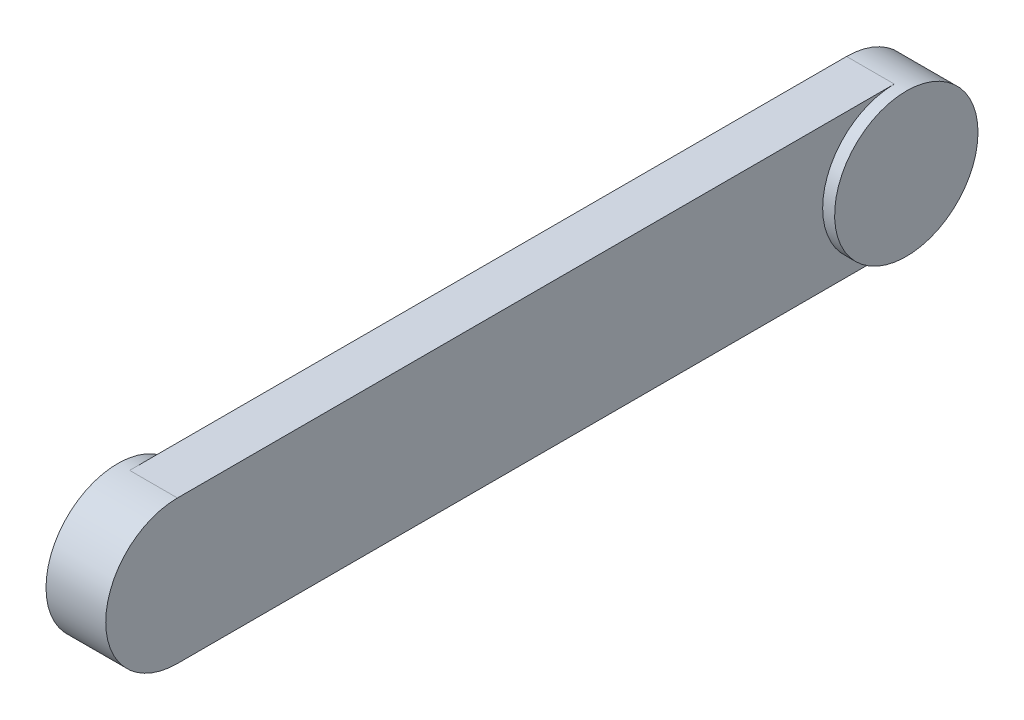
ISO-10303-21;
HEADER;
FILE_DESCRIPTION(('STEP AP214'),'2;1');
FILE_NAME('part.step','',(''),(''),'','','');
FILE_SCHEMA(('AUTOMOTIVE_DESIGN { 1 0 10303 214 1 1 1 1 }'));
ENDSEC;
DATA;
#1=APPLICATION_CONTEXT('core data for automotive mechanical design processes');
#2=APPLICATION_PROTOCOL_DEFINITION('international standard','automotive_design',2000,#1);
#3=PRODUCT_CONTEXT('',#1,'mechanical');
#4=PRODUCT('Part','Part','',(#3));
#5=PRODUCT_RELATED_PRODUCT_CATEGORY('part','',(#4));
#6=PRODUCT_DEFINITION_FORMATION('','',#4);
#7=PRODUCT_DEFINITION_CONTEXT('part definition',#1,'design');
#8=PRODUCT_DEFINITION('design','',#6,#7);
#9=PRODUCT_DEFINITION_SHAPE('','',#8);
#10=(LENGTH_UNIT() NAMED_UNIT(*) SI_UNIT(.MILLI.,.METRE.));
#11=(NAMED_UNIT(*) PLANE_ANGLE_UNIT() SI_UNIT($,.RADIAN.));
#12=(NAMED_UNIT(*) SI_UNIT($,.STERADIAN.) SOLID_ANGLE_UNIT());
#13=UNCERTAINTY_MEASURE_WITH_UNIT(LENGTH_MEASURE(1.E-05),#10,'distance_accuracy_value','');
#14=(GEOMETRIC_REPRESENTATION_CONTEXT(3) GLOBAL_UNCERTAINTY_ASSIGNED_CONTEXT((#13)) GLOBAL_UNIT_ASSIGNED_CONTEXT((#10,
#11,#12)) REPRESENTATION_CONTEXT('',''));
#15=CARTESIAN_POINT('',(0.,0.,0.));
#16=DIRECTION('',(0.,0.,1.));
#17=DIRECTION('',(1.,0.,0.));
#18=AXIS2_PLACEMENT_3D('',#15,#16,#17);
#19=CARTESIAN_POINT('',(0.,0.,0.));
#20=DIRECTION('',(1.,0.,0.));
#21=DIRECTION('',(0.,0.,-1.));
#22=AXIS2_PLACEMENT_3D('',#19,#20,#21);
#23=PLANE('',#22);
#24=CARTESIAN_POINT('',(0.,0.,0.));
#25=DIRECTION('',(-1.,0.,0.));
#26=DIRECTION('',(0.,0.,1.));
#27=AXIS2_PLACEMENT_3D('',#24,#25,#26);
#28=CIRCLE('',#27,30.);
#29=CARTESIAN_POINT('',(0.,30.,0.));
#30=VERTEX_POINT('',#29);
#31=CARTESIAN_POINT('',(0.,-30.,0.));
#32=VERTEX_POINT('',#31);
#33=EDGE_CURVE('E86',#30,#32,#28,.T.);
#34=ORIENTED_EDGE('',*,*,#33,.F.);
#35=DIRECTION('',(0.,0.,1.));
#36=VECTOR('',#35,1.);
#37=CARTESIAN_POINT('',(0.,30.,0.));
#38=LINE('',#37,#36);
#39=CARTESIAN_POINT('',(0.,30.,-300.));
#40=VERTEX_POINT('',#39);
#41=EDGE_CURVE('E88',#40,#30,#38,.T.);
#42=ORIENTED_EDGE('',*,*,#41,.F.);
#43=CARTESIAN_POINT('',(0.,0.,-300.));
#44=DIRECTION('',(1.,0.,0.));
#45=DIRECTION('',(0.,0.,-1.));
#46=AXIS2_PLACEMENT_3D('',#43,#44,#45);
#47=CIRCLE('',#46,30.);
#48=CARTESIAN_POINT('',(0.,-30.,-300.));
#49=VERTEX_POINT('',#48);
#50=EDGE_CURVE('E76',#49,#40,#47,.T.);
#51=ORIENTED_EDGE('',*,*,#50,.F.);
#52=DIRECTION('',(0.,0.,-1.));
#53=VECTOR('',#52,1.);
#54=CARTESIAN_POINT('',(0.,-30.,0.));
#55=LINE('',#54,#53);
#56=EDGE_CURVE('E70',#32,#49,#55,.T.);
#57=ORIENTED_EDGE('',*,*,#56,.F.);
#58=EDGE_LOOP('',(#34,#42,#51,#57));
#59=FACE_BOUND('',#58,.T.);
#60=ADVANCED_FACE('F38',(#59),#23,.F.);
#61=CARTESIAN_POINT('',(20.,0.,0.));
#62=DIRECTION('',(-1.,0.,0.));
#63=DIRECTION('',(0.,0.,1.));
#64=AXIS2_PLACEMENT_3D('',#61,#62,#63);
#65=CYLINDRICAL_SURFACE('',#64,30.);
#66=DIRECTION('',(-1.,0.,0.));
#67=VECTOR('',#66,1.);
#68=CARTESIAN_POINT('',(20.,30.,0.));
#69=LINE('',#68,#67);
#70=CARTESIAN_POINT('',(20.,30.,0.));
#71=VERTEX_POINT('',#70);
#72=EDGE_CURVE('E96',#71,#30,#69,.T.);
#73=ORIENTED_EDGE('',*,*,#72,.T.);
#74=ORIENTED_EDGE('',*,*,#33,.T.);
#75=DIRECTION('',(-1.,0.,0.));
#76=VECTOR('',#75,1.);
#77=CARTESIAN_POINT('',(20.,-30.,0.));
#78=LINE('',#77,#76);
#79=CARTESIAN_POINT('',(20.,-30.,0.));
#80=VERTEX_POINT('',#79);
#81=EDGE_CURVE('E11',#80,#32,#78,.T.);
#82=ORIENTED_EDGE('',*,*,#81,.F.);
#83=CARTESIAN_POINT('',(20.,0.,0.));
#84=DIRECTION('',(1.,0.,0.));
#85=DIRECTION('',(0.,0.,-1.));
#86=AXIS2_PLACEMENT_3D('',#83,#84,#85);
#87=CIRCLE('',#86,30.);
#88=EDGE_CURVE('E99',#71,#80,#87,.T.);
#89=ORIENTED_EDGE('',*,*,#88,.F.);
#90=EDGE_LOOP('',(#73,#74,#82,#89));
#91=FACE_BOUND('',#90,.T.);
#92=CARTESIAN_POINT('',(-5.,0.,0.));
#93=DIRECTION('',(-1.,0.,0.));
#94=DIRECTION('',(0.,0.,1.));
#95=AXIS2_PLACEMENT_3D('',#92,#93,#94);
#96=CIRCLE('',#95,30.);
#97=CARTESIAN_POINT('',(-5.,0.,30.));
#98=VERTEX_POINT('',#97);
#99=EDGE_CURVE('E92',#98,#98,#96,.T.);
#100=ORIENTED_EDGE('',*,*,#99,.F.);
#101=EDGE_LOOP('',(#100));
#102=FACE_BOUND('',#101,.T.);
#103=ADVANCED_FACE('F40',(#91,#102),#65,.T.);
#104=CARTESIAN_POINT('',(20.,-30.,0.));
#105=DIRECTION('',(0.,1.,0.));
#106=DIRECTION('',(0.,0.,1.));
#107=AXIS2_PLACEMENT_3D('',#104,#105,#106);
#108=PLANE('',#107);
#109=ORIENTED_EDGE('',*,*,#56,.T.);
#110=DIRECTION('',(-1.,0.,0.));
#111=VECTOR('',#110,1.);
#112=CARTESIAN_POINT('',(20.,-30.,-300.));
#113=LINE('',#112,#111);
#114=CARTESIAN_POINT('',(20.,-30.,-300.));
#115=VERTEX_POINT('',#114);
#116=EDGE_CURVE('E47',#115,#49,#113,.T.);
#117=ORIENTED_EDGE('',*,*,#116,.F.);
#118=DIRECTION('',(0.,0.,-1.));
#119=VECTOR('',#118,1.);
#120=CARTESIAN_POINT('',(20.,-30.,0.));
#121=LINE('',#120,#119);
#122=EDGE_CURVE('E79',#80,#115,#121,.T.);
#123=ORIENTED_EDGE('',*,*,#122,.F.);
#124=ORIENTED_EDGE('',*,*,#81,.T.);
#125=EDGE_LOOP('',(#109,#117,#123,#124));
#126=FACE_BOUND('',#125,.T.);
#127=ADVANCED_FACE('F123',(#126),#108,.F.);
#128=CARTESIAN_POINT('',(20.,0.,-300.));
#129=DIRECTION('',(-1.,0.,0.));
#130=DIRECTION('',(0.,0.,1.));
#131=AXIS2_PLACEMENT_3D('',#128,#129,#130);
#132=CYLINDRICAL_SURFACE('',#131,30.);
#133=ORIENTED_EDGE('',*,*,#50,.T.);
#134=DIRECTION('',(-1.,0.,0.));
#135=VECTOR('',#134,1.);
#136=CARTESIAN_POINT('',(20.,30.,-300.));
#137=LINE('',#136,#135);
#138=CARTESIAN_POINT('',(20.,30.,-300.));
#139=VERTEX_POINT('',#138);
#140=EDGE_CURVE('E98',#139,#40,#137,.T.);
#141=ORIENTED_EDGE('',*,*,#140,.F.);
#142=CARTESIAN_POINT('',(20.,0.,-300.));
#143=DIRECTION('',(1.,0.,0.));
#144=DIRECTION('',(0.,0.,-1.));
#145=AXIS2_PLACEMENT_3D('',#142,#143,#144);
#146=CIRCLE('',#145,30.);
#147=EDGE_CURVE('E109',#139,#115,#146,.T.);
#148=ORIENTED_EDGE('',*,*,#147,.T.);
#149=ORIENTED_EDGE('',*,*,#116,.T.);
#150=EDGE_LOOP('',(#133,#141,#148,#149));
#151=FACE_BOUND('',#150,.T.);
#152=CARTESIAN_POINT('',(25.,0.,-300.));
#153=DIRECTION('',(1.,0.,0.));
#154=DIRECTION('',(0.,0.,-1.));
#155=AXIS2_PLACEMENT_3D('',#152,#153,#154);
#156=CIRCLE('',#155,30.);
#157=CARTESIAN_POINT('',(25.,0.,-330.));
#158=VERTEX_POINT('',#157);
#159=EDGE_CURVE('E110',#158,#158,#156,.T.);
#160=ORIENTED_EDGE('',*,*,#159,.F.);
#161=EDGE_LOOP('',(#160));
#162=FACE_BOUND('',#161,.T.);
#163=ADVANCED_FACE('F107',(#151,#162),#132,.T.);
#164=CARTESIAN_POINT('',(20.,30.,0.));
#165=DIRECTION('',(0.,-1.,0.));
#166=DIRECTION('',(0.,0.,-1.));
#167=AXIS2_PLACEMENT_3D('',#164,#165,#166);
#168=PLANE('',#167);
#169=ORIENTED_EDGE('',*,*,#41,.T.);
#170=ORIENTED_EDGE('',*,*,#72,.F.);
#171=DIRECTION('',(0.,0.,1.));
#172=VECTOR('',#171,1.);
#173=CARTESIAN_POINT('',(20.,30.,0.));
#174=LINE('',#173,#172);
#175=EDGE_CURVE('E55',#139,#71,#174,.T.);
#176=ORIENTED_EDGE('',*,*,#175,.F.);
#177=ORIENTED_EDGE('',*,*,#140,.T.);
#178=EDGE_LOOP('',(#169,#170,#176,#177));
#179=FACE_BOUND('',#178,.T.);
#180=ADVANCED_FACE('F95',(#179),#168,.F.);
#181=CARTESIAN_POINT('',(20.,0.,0.));
#182=DIRECTION('',(1.,0.,0.));
#183=DIRECTION('',(0.,0.,-1.));
#184=AXIS2_PLACEMENT_3D('',#181,#182,#183);
#185=PLANE('',#184);
#186=ORIENTED_EDGE('',*,*,#147,.F.);
#187=ORIENTED_EDGE('',*,*,#175,.T.);
#188=ORIENTED_EDGE('',*,*,#88,.T.);
#189=ORIENTED_EDGE('',*,*,#122,.T.);
#190=EDGE_LOOP('',(#186,#187,#188,#189));
#191=FACE_BOUND('',#190,.T.);
#192=ADVANCED_FACE('F133',(#191),#185,.T.);
#193=CARTESIAN_POINT('',(25.,0.,-300.));
#194=DIRECTION('',(1.,0.,0.));
#195=DIRECTION('',(0.,0.,-1.));
#196=AXIS2_PLACEMENT_3D('',#193,#194,#195);
#197=PLANE('',#196);
#198=ORIENTED_EDGE('',*,*,#159,.T.);
#199=EDGE_LOOP('',(#198));
#200=FACE_BOUND('',#199,.T.);
#201=ADVANCED_FACE('F153',(#200),#197,.T.);
#202=CARTESIAN_POINT('',(-5.,0.,0.));
#203=DIRECTION('',(-1.,0.,0.));
#204=DIRECTION('',(0.,0.,1.));
#205=AXIS2_PLACEMENT_3D('',#202,#203,#204);
#206=PLANE('',#205);
#207=ORIENTED_EDGE('',*,*,#99,.T.);
#208=EDGE_LOOP('',(#207));
#209=FACE_BOUND('',#208,.T.);
#210=ADVANCED_FACE('F121',(#209),#206,.T.);
#211=CLOSED_SHELL('',(#60,#103,#127,#163,#180,#192,#201,#210));
#212=MANIFOLD_SOLID_BREP('B2',#211);
#213=ADVANCED_BREP_SHAPE_REPRESENTATION('',(#18,#212),#14);
#214=SHAPE_DEFINITION_REPRESENTATION(#9,#213);
ENDSEC;
END-ISO-10303-21;
